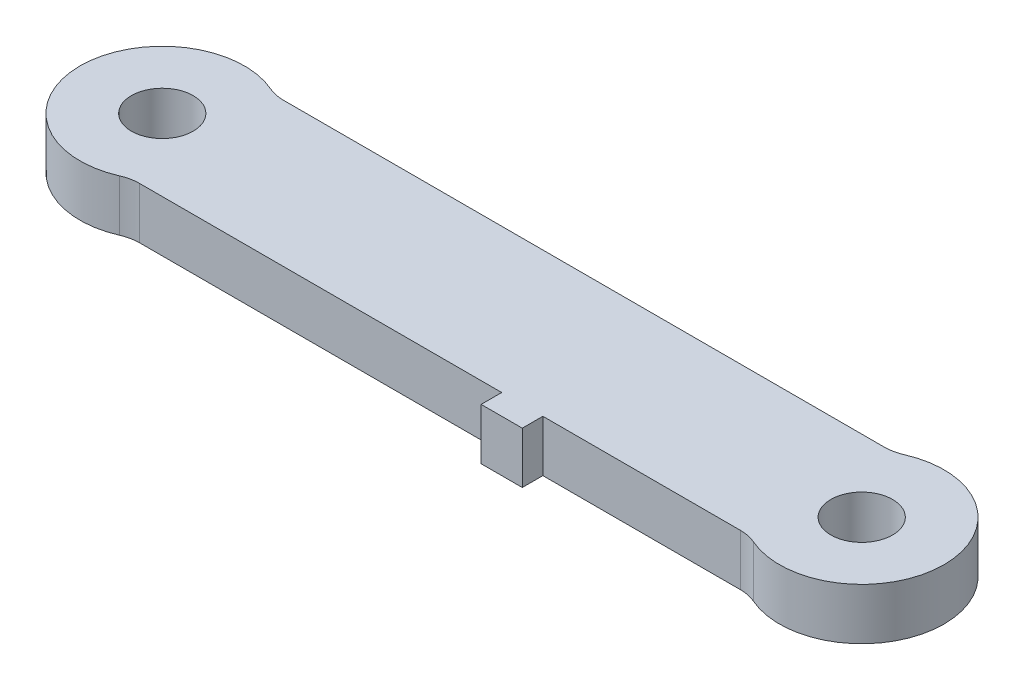
ISO-10303-21;
HEADER;
FILE_DESCRIPTION(('STEP AP214'),'2;1');
FILE_NAME('part.step','',(''),(''),'','','');
FILE_SCHEMA(('AUTOMOTIVE_DESIGN { 1 0 10303 214 1 1 1 1 }'));
ENDSEC;
DATA;
#1=APPLICATION_CONTEXT('core data for automotive mechanical design processes');
#2=APPLICATION_PROTOCOL_DEFINITION('international standard','automotive_design',2000,#1);
#3=PRODUCT_CONTEXT('',#1,'mechanical');
#4=PRODUCT('Part','Part','',(#3));
#5=PRODUCT_RELATED_PRODUCT_CATEGORY('part','',(#4));
#6=PRODUCT_DEFINITION_FORMATION('','',#4);
#7=PRODUCT_DEFINITION_CONTEXT('part definition',#1,'design');
#8=PRODUCT_DEFINITION('design','',#6,#7);
#9=PRODUCT_DEFINITION_SHAPE('','',#8);
#10=(LENGTH_UNIT() NAMED_UNIT(*) SI_UNIT(.MILLI.,.METRE.));
#11=(NAMED_UNIT(*) PLANE_ANGLE_UNIT() SI_UNIT($,.RADIAN.));
#12=(NAMED_UNIT(*) SI_UNIT($,.STERADIAN.) SOLID_ANGLE_UNIT());
#13=UNCERTAINTY_MEASURE_WITH_UNIT(LENGTH_MEASURE(1.E-05),#10,'distance_accuracy_value','');
#14=(GEOMETRIC_REPRESENTATION_CONTEXT(3) GLOBAL_UNCERTAINTY_ASSIGNED_CONTEXT((#13)) GLOBAL_UNIT_ASSIGNED_CONTEXT((#10,
#11,#12)) REPRESENTATION_CONTEXT('',''));
#15=CARTESIAN_POINT('',(0.,0.,0.));
#16=DIRECTION('',(0.,0.,1.));
#17=DIRECTION('',(1.,0.,0.));
#18=AXIS2_PLACEMENT_3D('',#15,#16,#17);
#19=CARTESIAN_POINT('',(0.,3.175,4.445));
#20=DIRECTION('',(0.,0.,-1.));
#21=DIRECTION('',(-1.,0.,0.));
#22=AXIS2_PLACEMENT_3D('',#19,#20,#21);
#23=PLANE('',#22);
#24=DIRECTION('',(0.,-1.,0.));
#25=VECTOR('',#24,1.);
#26=CARTESIAN_POINT('',(25.4,3.175,4.445));
#27=LINE('',#26,#25);
#28=CARTESIAN_POINT('',(25.4,3.175,4.445));
#29=VERTEX_POINT('',#28);
#30=CARTESIAN_POINT('',(25.4,0.,4.445));
#31=VERTEX_POINT('',#30);
#32=EDGE_CURVE('E60',#29,#31,#27,.T.);
#33=ORIENTED_EDGE('',*,*,#32,.F.);
#34=DIRECTION('',(1.,0.,0.));
#35=VECTOR('',#34,1.);
#36=CARTESIAN_POINT('',(0.,3.175,4.445));
#37=LINE('',#36,#35);
#38=CARTESIAN_POINT('',(3.04535301730358,3.175,4.445));
#39=VERTEX_POINT('',#38);
#40=EDGE_CURVE('E256',#39,#29,#37,.T.);
#41=ORIENTED_EDGE('',*,*,#40,.F.);
#42=DIRECTION('',(0.,1.,0.));
#43=VECTOR('',#42,1.);
#44=CARTESIAN_POINT('',(3.04535301730358,0.,4.445));
#45=LINE('',#44,#43);
#46=CARTESIAN_POINT('',(3.04535301730358,0.,4.445));
#47=VERTEX_POINT('',#46);
#48=EDGE_CURVE('E199',#39,#47,#45,.F.);
#49=ORIENTED_EDGE('',*,*,#48,.T.);
#50=DIRECTION('',(1.,0.,0.));
#51=VECTOR('',#50,1.);
#52=CARTESIAN_POINT('',(0.,0.,4.445));
#53=LINE('',#52,#51);
#54=EDGE_CURVE('E188',#47,#31,#53,.T.);
#55=ORIENTED_EDGE('',*,*,#54,.T.);
#56=EDGE_LOOP('',(#33,#41,#49,#55));
#57=FACE_BOUND('',#56,.T.);
#58=ADVANCED_FACE('F37',(#57),#23,.F.);
#59=DIRECTION('',(0.,1.,0.));
#60=VECTOR('',#59,1.);
#61=CARTESIAN_POINT('',(27.94,3.175,4.445));
#62=LINE('',#61,#60);
#63=CARTESIAN_POINT('',(27.94,0.,4.445));
#64=VERTEX_POINT('',#63);
#65=CARTESIAN_POINT('',(27.94,3.175,4.445));
#66=VERTEX_POINT('',#65);
#67=EDGE_CURVE('E149',#64,#66,#62,.T.);
#68=ORIENTED_EDGE('',*,*,#67,.F.);
#69=CARTESIAN_POINT('',(40.1346469826964,0.,4.445));
#70=VERTEX_POINT('',#69);
#71=EDGE_CURVE('E187',#64,#70,#53,.T.);
#72=ORIENTED_EDGE('',*,*,#71,.T.);
#73=DIRECTION('',(0.,1.,0.));
#74=VECTOR('',#73,1.);
#75=CARTESIAN_POINT('',(40.1346469826964,3.175,4.445));
#76=LINE('',#75,#74);
#77=CARTESIAN_POINT('',(40.1346469826964,3.175,4.445));
#78=VERTEX_POINT('',#77);
#79=EDGE_CURVE('E183',#70,#78,#76,.T.);
#80=ORIENTED_EDGE('',*,*,#79,.T.);
#81=EDGE_CURVE('E52',#66,#78,#37,.T.);
#82=ORIENTED_EDGE('',*,*,#81,.F.);
#83=EDGE_LOOP('',(#68,#72,#80,#82));
#84=FACE_BOUND('',#83,.T.);
#85=ADVANCED_FACE('F234',(#84),#23,.F.);
#86=CARTESIAN_POINT('',(0.,3.175,0.));
#87=DIRECTION('',(0.,-1.,0.));
#88=DIRECTION('',(0.,0.,-1.));
#89=AXIS2_PLACEMENT_3D('',#86,#87,#88);
#90=CYLINDRICAL_SURFACE('',#89,5.08);
#91=CARTESIAN_POINT('',(0.,0.,0.));
#92=DIRECTION('',(0.,1.,0.));
#93=DIRECTION('',(0.,0.,1.));
#94=AXIS2_PLACEMENT_3D('',#91,#92,#93);
#95=CIRCLE('',#94,5.08);
#96=CARTESIAN_POINT('',(2.03023534486905,0.,-4.65666666666667));
#97=VERTEX_POINT('',#96);
#98=CARTESIAN_POINT('',(2.03023534486905,0.,4.65666666666667));
#99=VERTEX_POINT('',#98);
#100=EDGE_CURVE('E155',#97,#99,#95,.T.);
#101=ORIENTED_EDGE('',*,*,#100,.T.);
#102=DIRECTION('',(0.,-1.,0.));
#103=VECTOR('',#102,1.);
#104=CARTESIAN_POINT('',(2.03023534486905,3.175,4.65666666666667));
#105=LINE('',#104,#103);
#106=CARTESIAN_POINT('',(2.03023534486905,3.175,4.65666666666667));
#107=VERTEX_POINT('',#106);
#108=EDGE_CURVE('E205',#99,#107,#105,.F.);
#109=ORIENTED_EDGE('',*,*,#108,.T.);
#110=CARTESIAN_POINT('',(0.,3.175,0.));
#111=DIRECTION('',(0.,1.,0.));
#112=DIRECTION('',(0.,0.,1.));
#113=AXIS2_PLACEMENT_3D('',#110,#111,#112);
#114=CIRCLE('',#113,5.08);
#115=CARTESIAN_POINT('',(2.03023534486905,3.175,-4.65666666666667));
#116=VERTEX_POINT('',#115);
#117=EDGE_CURVE('E165',#116,#107,#114,.T.);
#118=ORIENTED_EDGE('',*,*,#117,.F.);
#119=DIRECTION('',(0.,-1.,0.));
#120=VECTOR('',#119,1.);
#121=CARTESIAN_POINT('',(2.03023534486905,3.175,-4.65666666666667));
#122=LINE('',#121,#120);
#123=EDGE_CURVE('E202',#116,#97,#122,.T.);
#124=ORIENTED_EDGE('',*,*,#123,.T.);
#125=EDGE_LOOP('',(#101,#109,#118,#124));
#126=FACE_BOUND('',#125,.T.);
#127=ADVANCED_FACE('F270',(#126),#90,.T.);
#128=CARTESIAN_POINT('',(43.18,3.175,0.));
#129=DIRECTION('',(0.,-1.,0.));
#130=DIRECTION('',(0.,0.,-1.));
#131=AXIS2_PLACEMENT_3D('',#128,#129,#130);
#132=CYLINDRICAL_SURFACE('',#131,5.08000000000001);
#133=CARTESIAN_POINT('',(43.18,0.,0.));
#134=DIRECTION('',(0.,1.,0.));
#135=DIRECTION('',(0.,0.,1.));
#136=AXIS2_PLACEMENT_3D('',#133,#134,#135);
#137=CIRCLE('',#136,5.08000000000001);
#138=CARTESIAN_POINT('',(41.1497646551309,0.,4.65666666666667));
#139=VERTEX_POINT('',#138);
#140=CARTESIAN_POINT('',(41.1497646551309,0.,-4.65666666666667));
#141=VERTEX_POINT('',#140);
#142=EDGE_CURVE('E190',#139,#141,#137,.T.);
#143=ORIENTED_EDGE('',*,*,#142,.T.);
#144=DIRECTION('',(0.,-1.,0.));
#145=VECTOR('',#144,1.);
#146=CARTESIAN_POINT('',(41.1497646551309,3.175,-4.65666666666667));
#147=LINE('',#146,#145);
#148=CARTESIAN_POINT('',(41.1497646551309,3.175,-4.65666666666667));
#149=VERTEX_POINT('',#148);
#150=EDGE_CURVE('E215',#141,#149,#147,.F.);
#151=ORIENTED_EDGE('',*,*,#150,.T.);
#152=CARTESIAN_POINT('',(43.18,3.175,0.));
#153=DIRECTION('',(0.,1.,0.));
#154=DIRECTION('',(0.,0.,1.));
#155=AXIS2_PLACEMENT_3D('',#152,#153,#154);
#156=CIRCLE('',#155,5.08000000000001);
#157=CARTESIAN_POINT('',(41.1497646551309,3.175,4.65666666666667));
#158=VERTEX_POINT('',#157);
#159=EDGE_CURVE('E179',#158,#149,#156,.T.);
#160=ORIENTED_EDGE('',*,*,#159,.F.);
#161=DIRECTION('',(0.,-1.,0.));
#162=VECTOR('',#161,1.);
#163=CARTESIAN_POINT('',(41.1497646551309,3.175,4.65666666666667));
#164=LINE('',#163,#162);
#165=EDGE_CURVE('E212',#158,#139,#164,.T.);
#166=ORIENTED_EDGE('',*,*,#165,.T.);
#167=EDGE_LOOP('',(#143,#151,#160,#166));
#168=FACE_BOUND('',#167,.T.);
#169=ADVANCED_FACE('F283',(#168),#132,.T.);
#170=CARTESIAN_POINT('',(0.,3.175,-4.445));
#171=DIRECTION('',(0.,0.,-1.));
#172=DIRECTION('',(-1.,0.,0.));
#173=AXIS2_PLACEMENT_3D('',#170,#171,#172);
#174=PLANE('',#173);
#175=DIRECTION('',(1.,0.,0.));
#176=VECTOR('',#175,1.);
#177=CARTESIAN_POINT('',(0.,0.,-4.445));
#178=LINE('',#177,#176);
#179=CARTESIAN_POINT('',(3.04535301730358,0.,-4.445));
#180=VERTEX_POINT('',#179);
#181=CARTESIAN_POINT('',(40.1346469826964,0.,-4.445));
#182=VERTEX_POINT('',#181);
#183=EDGE_CURVE('E193',#180,#182,#178,.T.);
#184=ORIENTED_EDGE('',*,*,#183,.F.);
#185=DIRECTION('',(0.,-1.,0.));
#186=VECTOR('',#185,1.);
#187=CARTESIAN_POINT('',(3.04535301730358,3.175,-4.445));
#188=LINE('',#187,#186);
#189=CARTESIAN_POINT('',(3.04535301730358,3.175,-4.445));
#190=VERTEX_POINT('',#189);
#191=EDGE_CURVE('E210',#180,#190,#188,.F.);
#192=ORIENTED_EDGE('',*,*,#191,.T.);
#193=DIRECTION('',(1.,0.,0.));
#194=VECTOR('',#193,1.);
#195=CARTESIAN_POINT('',(0.,3.175,-4.445));
#196=LINE('',#195,#194);
#197=CARTESIAN_POINT('',(40.1346469826964,3.175,-4.445));
#198=VERTEX_POINT('',#197);
#199=EDGE_CURVE('E174',#190,#198,#196,.T.);
#200=ORIENTED_EDGE('',*,*,#199,.T.);
#201=DIRECTION('',(0.,-1.,0.));
#202=VECTOR('',#201,1.);
#203=CARTESIAN_POINT('',(40.1346469826964,3.175,-4.445));
#204=LINE('',#203,#202);
#205=EDGE_CURVE('E207',#198,#182,#204,.T.);
#206=ORIENTED_EDGE('',*,*,#205,.T.);
#207=EDGE_LOOP('',(#184,#192,#200,#206));
#208=FACE_BOUND('',#207,.T.);
#209=ADVANCED_FACE('F276',(#208),#174,.T.);
#210=CARTESIAN_POINT('',(0.,3.175,0.));
#211=DIRECTION('',(0.,-1.,0.));
#212=DIRECTION('',(0.,0.,-1.));
#213=AXIS2_PLACEMENT_3D('',#210,#211,#212);
#214=CYLINDRICAL_SURFACE('',#213,1.905);
#215=CARTESIAN_POINT('',(0.,3.175,0.));
#216=DIRECTION('',(0.,1.,0.));
#217=DIRECTION('',(0.,0.,1.));
#218=AXIS2_PLACEMENT_3D('',#215,#216,#217);
#219=CIRCLE('',#218,1.905);
#220=CARTESIAN_POINT('',(0.,3.175,1.905));
#221=VERTEX_POINT('',#220);
#222=EDGE_CURVE('E161',#221,#221,#219,.T.);
#223=ORIENTED_EDGE('',*,*,#222,.T.);
#224=EDGE_LOOP('',(#223));
#225=FACE_BOUND('',#224,.T.);
#226=CARTESIAN_POINT('',(0.,0.,0.));
#227=DIRECTION('',(0.,1.,0.));
#228=DIRECTION('',(0.,0.,1.));
#229=AXIS2_PLACEMENT_3D('',#226,#227,#228);
#230=CIRCLE('',#229,1.905);
#231=CARTESIAN_POINT('',(0.,0.,1.905));
#232=VERTEX_POINT('',#231);
#233=EDGE_CURVE('E152',#232,#232,#230,.T.);
#234=ORIENTED_EDGE('',*,*,#233,.F.);
#235=EDGE_LOOP('',(#234));
#236=FACE_BOUND('',#235,.T.);
#237=ADVANCED_FACE('F291',(#225,#236),#214,.F.);
#238=CARTESIAN_POINT('',(43.18,3.175,0.));
#239=DIRECTION('',(0.,-1.,0.));
#240=DIRECTION('',(0.,0.,-1.));
#241=AXIS2_PLACEMENT_3D('',#238,#239,#240);
#242=CYLINDRICAL_SURFACE('',#241,1.905);
#243=CARTESIAN_POINT('',(43.18,3.175,0.));
#244=DIRECTION('',(0.,1.,0.));
#245=DIRECTION('',(0.,0.,1.));
#246=AXIS2_PLACEMENT_3D('',#243,#244,#245);
#247=CIRCLE('',#246,1.905);
#248=CARTESIAN_POINT('',(43.18,3.175,1.905));
#249=VERTEX_POINT('',#248);
#250=EDGE_CURVE('E178',#249,#249,#247,.T.);
#251=ORIENTED_EDGE('',*,*,#250,.T.);
#252=EDGE_LOOP('',(#251));
#253=FACE_BOUND('',#252,.T.);
#254=CARTESIAN_POINT('',(43.18,0.,0.));
#255=DIRECTION('',(0.,1.,0.));
#256=DIRECTION('',(0.,0.,1.));
#257=AXIS2_PLACEMENT_3D('',#254,#255,#256);
#258=CIRCLE('',#257,1.905);
#259=CARTESIAN_POINT('',(43.18,0.,1.905));
#260=VERTEX_POINT('',#259);
#261=EDGE_CURVE('E166',#260,#260,#258,.T.);
#262=ORIENTED_EDGE('',*,*,#261,.F.);
#263=EDGE_LOOP('',(#262));
#264=FACE_BOUND('',#263,.T.);
#265=ADVANCED_FACE('F303',(#253,#264),#242,.F.);
#266=CARTESIAN_POINT('',(0.,3.175,0.));
#267=DIRECTION('',(0.,1.,0.));
#268=DIRECTION('',(0.,0.,1.));
#269=AXIS2_PLACEMENT_3D('',#266,#267,#268);
#270=PLANE('',#269);
#271=ORIENTED_EDGE('',*,*,#222,.F.);
#272=EDGE_LOOP('',(#271));
#273=FACE_BOUND('',#272,.T.);
#274=ORIENTED_EDGE('',*,*,#199,.F.);
#275=CARTESIAN_POINT('',(3.04535301730358,3.175,-6.985));
#276=DIRECTION('',(0.,1.,0.));
#277=DIRECTION('',(0.,0.,1.));
#278=AXIS2_PLACEMENT_3D('',#275,#276,#277);
#279=CIRCLE('',#278,2.54);
#280=EDGE_CURVE('E223',#190,#116,#279,.F.);
#281=ORIENTED_EDGE('',*,*,#280,.T.);
#282=ORIENTED_EDGE('',*,*,#117,.T.);
#283=CARTESIAN_POINT('',(3.04535301730358,3.175,6.985));
#284=DIRECTION('',(0.,1.,0.));
#285=DIRECTION('',(0.,0.,1.));
#286=AXIS2_PLACEMENT_3D('',#283,#284,#285);
#287=CIRCLE('',#286,2.54);
#288=EDGE_CURVE('E219',#107,#39,#287,.F.);
#289=ORIENTED_EDGE('',*,*,#288,.T.);
#290=ORIENTED_EDGE('',*,*,#40,.T.);
#291=DIRECTION('',(0.,0.,-1.));
#292=VECTOR('',#291,1.);
#293=CARTESIAN_POINT('',(25.4,3.175,5.715));
#294=LINE('',#293,#292);
#295=CARTESIAN_POINT('',(25.4,3.175,5.715));
#296=VERTEX_POINT('',#295);
#297=EDGE_CURVE('E241',#296,#29,#294,.T.);
#298=ORIENTED_EDGE('',*,*,#297,.F.);
#299=DIRECTION('',(-1.,0.,0.));
#300=VECTOR('',#299,1.);
#301=CARTESIAN_POINT('',(25.4,3.175,5.715));
#302=LINE('',#301,#300);
#303=CARTESIAN_POINT('',(27.94,3.175,5.715));
#304=VERTEX_POINT('',#303);
#305=EDGE_CURVE('E145',#304,#296,#302,.T.);
#306=ORIENTED_EDGE('',*,*,#305,.F.);
#307=DIRECTION('',(0.,0.,-1.));
#308=VECTOR('',#307,1.);
#309=CARTESIAN_POINT('',(27.94,3.175,5.715));
#310=LINE('',#309,#308);
#311=EDGE_CURVE('E157',#304,#66,#310,.T.);
#312=ORIENTED_EDGE('',*,*,#311,.T.);
#313=ORIENTED_EDGE('',*,*,#81,.T.);
#314=CARTESIAN_POINT('',(40.1346469826964,3.175,6.985));
#315=DIRECTION('',(0.,1.,0.));
#316=DIRECTION('',(0.,0.,1.));
#317=AXIS2_PLACEMENT_3D('',#314,#315,#316);
#318=CIRCLE('',#317,2.54);
#319=EDGE_CURVE('E12',#78,#158,#318,.F.);
#320=ORIENTED_EDGE('',*,*,#319,.T.);
#321=ORIENTED_EDGE('',*,*,#159,.T.);
#322=CARTESIAN_POINT('',(40.1346469826964,3.175,-6.985));
#323=DIRECTION('',(0.,1.,0.));
#324=DIRECTION('',(0.,0.,1.));
#325=AXIS2_PLACEMENT_3D('',#322,#323,#324);
#326=CIRCLE('',#325,2.54);
#327=EDGE_CURVE('E227',#149,#198,#326,.F.);
#328=ORIENTED_EDGE('',*,*,#327,.T.);
#329=EDGE_LOOP('',(#274,#281,#282,#289,#290,#298,#306,#312,#313,#320,#321,#328));
#330=FACE_BOUND('',#329,.T.);
#331=ORIENTED_EDGE('',*,*,#250,.F.);
#332=EDGE_LOOP('',(#331));
#333=FACE_BOUND('',#332,.T.);
#334=ADVANCED_FACE('F254',(#273,#330,#333),#270,.T.);
#335=CARTESIAN_POINT('',(0.,0.,0.));
#336=DIRECTION('',(0.,1.,0.));
#337=DIRECTION('',(0.,0.,1.));
#338=AXIS2_PLACEMENT_3D('',#335,#336,#337);
#339=PLANE('',#338);
#340=ORIENTED_EDGE('',*,*,#233,.T.);
#341=EDGE_LOOP('',(#340));
#342=FACE_BOUND('',#341,.T.);
#343=ORIENTED_EDGE('',*,*,#100,.F.);
#344=CARTESIAN_POINT('',(3.04535301730358,0.,-6.985));
#345=DIRECTION('',(0.,1.,0.));
#346=DIRECTION('',(0.,0.,1.));
#347=AXIS2_PLACEMENT_3D('',#344,#345,#346);
#348=CIRCLE('',#347,2.54);
#349=EDGE_CURVE('E221',#97,#180,#348,.T.);
#350=ORIENTED_EDGE('',*,*,#349,.T.);
#351=ORIENTED_EDGE('',*,*,#183,.T.);
#352=CARTESIAN_POINT('',(40.1346469826964,0.,-6.985));
#353=DIRECTION('',(0.,1.,0.));
#354=DIRECTION('',(0.,0.,1.));
#355=AXIS2_PLACEMENT_3D('',#352,#353,#354);
#356=CIRCLE('',#355,2.54);
#357=EDGE_CURVE('E225',#182,#141,#356,.T.);
#358=ORIENTED_EDGE('',*,*,#357,.T.);
#359=ORIENTED_EDGE('',*,*,#142,.F.);
#360=CARTESIAN_POINT('',(40.1346469826964,0.,6.985));
#361=DIRECTION('',(0.,1.,0.));
#362=DIRECTION('',(0.,0.,1.));
#363=AXIS2_PLACEMENT_3D('',#360,#361,#362);
#364=CIRCLE('',#363,2.54);
#365=EDGE_CURVE('E45',#139,#70,#364,.T.);
#366=ORIENTED_EDGE('',*,*,#365,.T.);
#367=ORIENTED_EDGE('',*,*,#71,.F.);
#368=DIRECTION('',(0.,0.,-1.));
#369=VECTOR('',#368,1.);
#370=CARTESIAN_POINT('',(27.94,0.,5.715));
#371=LINE('',#370,#369);
#372=CARTESIAN_POINT('',(27.94,0.,5.715));
#373=VERTEX_POINT('',#372);
#374=EDGE_CURVE('E136',#373,#64,#371,.T.);
#375=ORIENTED_EDGE('',*,*,#374,.F.);
#376=DIRECTION('',(1.,0.,0.));
#377=VECTOR('',#376,1.);
#378=CARTESIAN_POINT('',(25.4,0.,5.715));
#379=LINE('',#378,#377);
#380=CARTESIAN_POINT('',(25.4,0.,5.715));
#381=VERTEX_POINT('',#380);
#382=EDGE_CURVE('E127',#381,#373,#379,.T.);
#383=ORIENTED_EDGE('',*,*,#382,.F.);
#384=DIRECTION('',(0.,0.,-1.));
#385=VECTOR('',#384,1.);
#386=CARTESIAN_POINT('',(25.4,0.,5.715));
#387=LINE('',#386,#385);
#388=EDGE_CURVE('E134',#381,#31,#387,.T.);
#389=ORIENTED_EDGE('',*,*,#388,.T.);
#390=ORIENTED_EDGE('',*,*,#54,.F.);
#391=CARTESIAN_POINT('',(3.04535301730358,0.,6.985));
#392=DIRECTION('',(0.,1.,0.));
#393=DIRECTION('',(0.,0.,1.));
#394=AXIS2_PLACEMENT_3D('',#391,#392,#393);
#395=CIRCLE('',#394,2.54);
#396=EDGE_CURVE('E217',#47,#99,#395,.T.);
#397=ORIENTED_EDGE('',*,*,#396,.T.);
#398=EDGE_LOOP('',(#343,#350,#351,#358,#359,#366,#367,#375,#383,#389,#390,#397));
#399=FACE_BOUND('',#398,.T.);
#400=ORIENTED_EDGE('',*,*,#261,.T.);
#401=EDGE_LOOP('',(#400));
#402=FACE_BOUND('',#401,.T.);
#403=ADVANCED_FACE('F130',(#342,#399,#402),#339,.F.);
#404=CARTESIAN_POINT('',(3.04535301730358,3.175,6.985));
#405=DIRECTION('',(0.,-1.,0.));
#406=DIRECTION('',(0.,0.,-1.));
#407=AXIS2_PLACEMENT_3D('',#404,#405,#406);
#408=CYLINDRICAL_SURFACE('',#407,2.54);
#409=ORIENTED_EDGE('',*,*,#288,.F.);
#410=ORIENTED_EDGE('',*,*,#108,.F.);
#411=ORIENTED_EDGE('',*,*,#396,.F.);
#412=ORIENTED_EDGE('',*,*,#48,.F.);
#413=EDGE_LOOP('',(#409,#410,#411,#412));
#414=FACE_BOUND('',#413,.T.);
#415=ADVANCED_FACE('F269',(#414),#408,.F.);
#416=CARTESIAN_POINT('',(3.04535301730358,3.175,-6.985));
#417=DIRECTION('',(0.,-1.,0.));
#418=DIRECTION('',(0.,0.,-1.));
#419=AXIS2_PLACEMENT_3D('',#416,#417,#418);
#420=CYLINDRICAL_SURFACE('',#419,2.54);
#421=ORIENTED_EDGE('',*,*,#280,.F.);
#422=ORIENTED_EDGE('',*,*,#191,.F.);
#423=ORIENTED_EDGE('',*,*,#349,.F.);
#424=ORIENTED_EDGE('',*,*,#123,.F.);
#425=EDGE_LOOP('',(#421,#422,#423,#424));
#426=FACE_BOUND('',#425,.T.);
#427=ADVANCED_FACE('F272',(#426),#420,.F.);
#428=CARTESIAN_POINT('',(40.1346469826964,3.175,-6.985));
#429=DIRECTION('',(0.,-1.,0.));
#430=DIRECTION('',(0.,0.,-1.));
#431=AXIS2_PLACEMENT_3D('',#428,#429,#430);
#432=CYLINDRICAL_SURFACE('',#431,2.54);
#433=ORIENTED_EDGE('',*,*,#327,.F.);
#434=ORIENTED_EDGE('',*,*,#150,.F.);
#435=ORIENTED_EDGE('',*,*,#357,.F.);
#436=ORIENTED_EDGE('',*,*,#205,.F.);
#437=EDGE_LOOP('',(#433,#434,#435,#436));
#438=FACE_BOUND('',#437,.T.);
#439=ADVANCED_FACE('F280',(#438),#432,.F.);
#440=CARTESIAN_POINT('',(40.1346469826964,3.175,6.985));
#441=DIRECTION('',(0.,-1.,0.));
#442=DIRECTION('',(0.,0.,-1.));
#443=AXIS2_PLACEMENT_3D('',#440,#441,#442);
#444=CYLINDRICAL_SURFACE('',#443,2.54);
#445=ORIENTED_EDGE('',*,*,#319,.F.);
#446=ORIENTED_EDGE('',*,*,#79,.F.);
#447=ORIENTED_EDGE('',*,*,#365,.F.);
#448=ORIENTED_EDGE('',*,*,#165,.F.);
#449=EDGE_LOOP('',(#445,#446,#447,#448));
#450=FACE_BOUND('',#449,.T.);
#451=ADVANCED_FACE('F39',(#450),#444,.F.);
#452=CARTESIAN_POINT('',(25.4,3.175,5.715));
#453=DIRECTION('',(1.,0.,0.));
#454=DIRECTION('',(0.,0.,-1.));
#455=AXIS2_PLACEMENT_3D('',#452,#453,#454);
#456=PLANE('',#455);
#457=ORIENTED_EDGE('',*,*,#32,.T.);
#458=ORIENTED_EDGE('',*,*,#388,.F.);
#459=DIRECTION('',(0.,-1.,0.));
#460=VECTOR('',#459,1.);
#461=CARTESIAN_POINT('',(25.4,3.175,5.715));
#462=LINE('',#461,#460);
#463=EDGE_CURVE('E140',#296,#381,#462,.T.);
#464=ORIENTED_EDGE('',*,*,#463,.F.);
#465=ORIENTED_EDGE('',*,*,#297,.T.);
#466=EDGE_LOOP('',(#457,#458,#464,#465));
#467=FACE_BOUND('',#466,.T.);
#468=ADVANCED_FACE('F151',(#467),#456,.F.);
#469=CARTESIAN_POINT('',(27.94,3.175,5.715));
#470=DIRECTION('',(-1.,0.,0.));
#471=DIRECTION('',(0.,0.,1.));
#472=AXIS2_PLACEMENT_3D('',#469,#470,#471);
#473=PLANE('',#472);
#474=ORIENTED_EDGE('',*,*,#67,.T.);
#475=ORIENTED_EDGE('',*,*,#311,.F.);
#476=DIRECTION('',(0.,1.,0.));
#477=VECTOR('',#476,1.);
#478=CARTESIAN_POINT('',(27.94,3.175,5.715));
#479=LINE('',#478,#477);
#480=EDGE_CURVE('E139',#373,#304,#479,.T.);
#481=ORIENTED_EDGE('',*,*,#480,.F.);
#482=ORIENTED_EDGE('',*,*,#374,.T.);
#483=EDGE_LOOP('',(#474,#475,#481,#482));
#484=FACE_BOUND('',#483,.T.);
#485=ADVANCED_FACE('F239',(#484),#473,.F.);
#486=CARTESIAN_POINT('',(0.,0.,5.715));
#487=DIRECTION('',(0.,0.,1.));
#488=DIRECTION('',(1.,0.,0.));
#489=AXIS2_PLACEMENT_3D('',#486,#487,#488);
#490=PLANE('',#489);
#491=ORIENTED_EDGE('',*,*,#463,.T.);
#492=ORIENTED_EDGE('',*,*,#382,.T.);
#493=ORIENTED_EDGE('',*,*,#480,.T.);
#494=ORIENTED_EDGE('',*,*,#305,.T.);
#495=EDGE_LOOP('',(#491,#492,#493,#494));
#496=FACE_BOUND('',#495,.T.);
#497=ADVANCED_FACE('F143',(#496),#490,.T.);
#498=CLOSED_SHELL('',(#58,#85,#127,#169,#209,#237,#265,#334,#403,#415,#427,#439,#451,#468,#485,#497));
#499=MANIFOLD_SOLID_BREP('B2',#498);
#500=ADVANCED_BREP_SHAPE_REPRESENTATION('',(#18,#499),#14);
#501=SHAPE_DEFINITION_REPRESENTATION(#9,#500);
ENDSEC;
END-ISO-10303-21;
